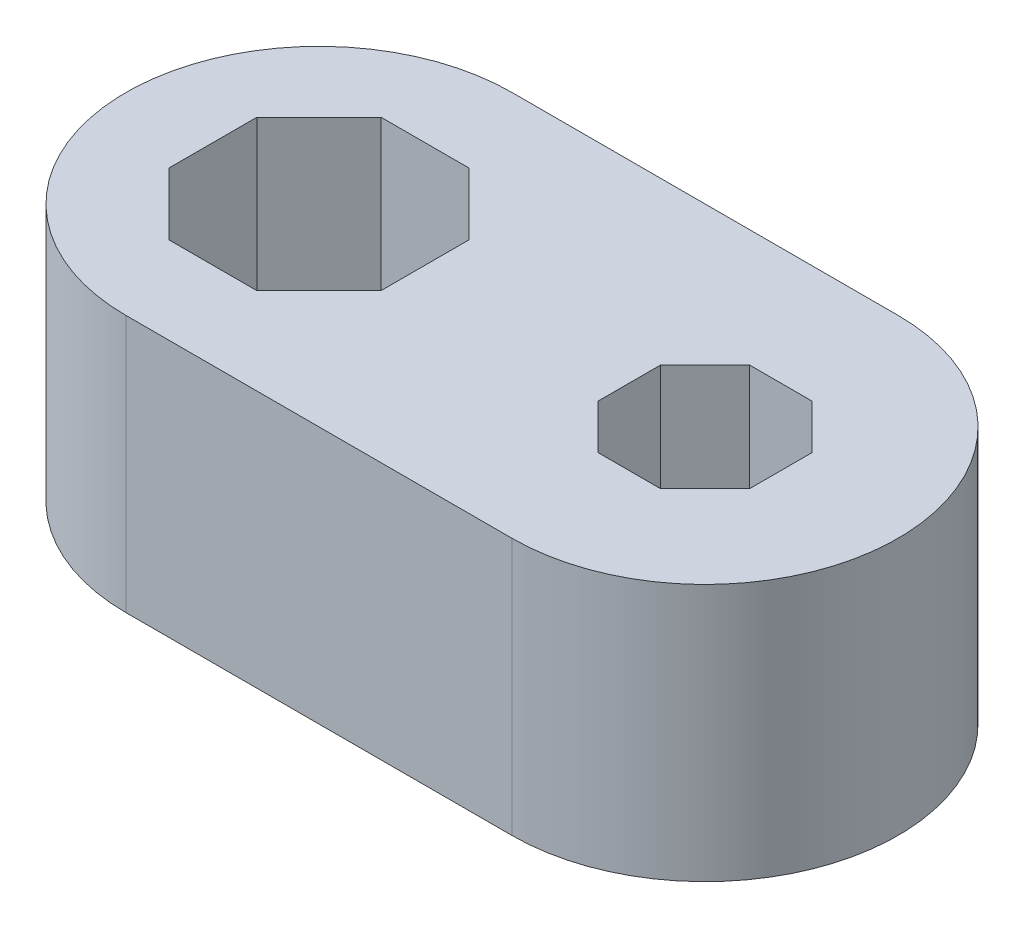
ISO-10303-21;
HEADER;
FILE_DESCRIPTION(('STEP AP214'),'2;1');
FILE_NAME('part.step','',(''),(''),'','','');
FILE_SCHEMA(('AUTOMOTIVE_DESIGN { 1 0 10303 214 1 1 1 1 }'));
ENDSEC;
DATA;
#1=APPLICATION_CONTEXT('core data for automotive mechanical design processes');
#2=APPLICATION_PROTOCOL_DEFINITION('international standard','automotive_design',2000,#1);
#3=PRODUCT_CONTEXT('',#1,'mechanical');
#4=PRODUCT('Part','Part','',(#3));
#5=PRODUCT_RELATED_PRODUCT_CATEGORY('part','',(#4));
#6=PRODUCT_DEFINITION_FORMATION('','',#4);
#7=PRODUCT_DEFINITION_CONTEXT('part definition',#1,'design');
#8=PRODUCT_DEFINITION('design','',#6,#7);
#9=PRODUCT_DEFINITION_SHAPE('','',#8);
#10=(LENGTH_UNIT() NAMED_UNIT(*) SI_UNIT(.MILLI.,.METRE.));
#11=(NAMED_UNIT(*) PLANE_ANGLE_UNIT() SI_UNIT($,.RADIAN.));
#12=(NAMED_UNIT(*) SI_UNIT($,.STERADIAN.) SOLID_ANGLE_UNIT());
#13=UNCERTAINTY_MEASURE_WITH_UNIT(LENGTH_MEASURE(1.E-05),#10,'distance_accuracy_value','');
#14=(GEOMETRIC_REPRESENTATION_CONTEXT(3) GLOBAL_UNCERTAINTY_ASSIGNED_CONTEXT((#13)) GLOBAL_UNIT_ASSIGNED_CONTEXT((#10,
#11,#12)) REPRESENTATION_CONTEXT('',''));
#15=CARTESIAN_POINT('',(0.,0.,0.));
#16=DIRECTION('',(0.,0.,1.));
#17=DIRECTION('',(1.,0.,0.));
#18=AXIS2_PLACEMENT_3D('',#15,#16,#17);
#19=CARTESIAN_POINT('',(6.,8.,0.));
#20=DIRECTION('',(0.,-1.,0.));
#21=DIRECTION('',(0.,0.,-1.));
#22=AXIS2_PLACEMENT_3D('',#19,#20,#21);
#23=PLANE('',#22);
#24=DIRECTION('',(-0.707106781186548,0.,-0.707106781186547));
#25=VECTOR('',#24,1.);
#26=CARTESIAN_POINT('',(-2.70174971535712,8.,-1.36618));
#27=LINE('',#26,#25);
#28=CARTESIAN_POINT('',(-2.70174971535712,8.,-1.36618));
#29=VERTEX_POINT('',#28);
#30=CARTESIAN_POINT('',(-4.63382,8.,-3.29825028464288));
#31=VERTEX_POINT('',#30);
#32=EDGE_CURVE('E266',#29,#31,#27,.T.);
#33=ORIENTED_EDGE('',*,*,#32,.F.);
#34=DIRECTION('',(0.,0.,-1.));
#35=VECTOR('',#34,1.);
#36=CARTESIAN_POINT('',(-2.70174971535712,8.,1.36618));
#37=LINE('',#36,#35);
#38=CARTESIAN_POINT('',(-2.70174971535712,8.,1.36618));
#39=VERTEX_POINT('',#38);
#40=EDGE_CURVE('E289',#39,#29,#37,.T.);
#41=ORIENTED_EDGE('',*,*,#40,.F.);
#42=DIRECTION('',(0.707106781186547,0.,-0.707106781186548));
#43=VECTOR('',#42,1.);
#44=CARTESIAN_POINT('',(-4.63382,8.,3.29825028464288));
#45=LINE('',#44,#43);
#46=CARTESIAN_POINT('',(-4.63382,8.,3.29825028464288));
#47=VERTEX_POINT('',#46);
#48=EDGE_CURVE('E285',#47,#39,#45,.T.);
#49=ORIENTED_EDGE('',*,*,#48,.F.);
#50=DIRECTION('',(1.,0.,0.));
#51=VECTOR('',#50,1.);
#52=CARTESIAN_POINT('',(-7.36618,8.,3.29825028464288));
#53=LINE('',#52,#51);
#54=CARTESIAN_POINT('',(-7.36618,8.,3.29825028464288));
#55=VERTEX_POINT('',#54);
#56=EDGE_CURVE('E282',#55,#47,#53,.T.);
#57=ORIENTED_EDGE('',*,*,#56,.F.);
#58=DIRECTION('',(0.707106781186547,0.,0.707106781186547));
#59=VECTOR('',#58,1.);
#60=CARTESIAN_POINT('',(-9.29825028464288,8.,1.36618));
#61=LINE('',#60,#59);
#62=CARTESIAN_POINT('',(-9.29825028464288,8.,1.36618));
#63=VERTEX_POINT('',#62);
#64=EDGE_CURVE('E279',#63,#55,#61,.T.);
#65=ORIENTED_EDGE('',*,*,#64,.F.);
#66=DIRECTION('',(0.,0.,1.));
#67=VECTOR('',#66,1.);
#68=CARTESIAN_POINT('',(-9.29825028464288,8.,-1.36618));
#69=LINE('',#68,#67);
#70=CARTESIAN_POINT('',(-9.29825028464288,8.,-1.36618));
#71=VERTEX_POINT('',#70);
#72=EDGE_CURVE('E276',#71,#63,#69,.T.);
#73=ORIENTED_EDGE('',*,*,#72,.F.);
#74=DIRECTION('',(-0.707106781186547,0.,0.707106781186548));
#75=VECTOR('',#74,1.);
#76=CARTESIAN_POINT('',(-7.36618,8.,-3.29825028464288));
#77=LINE('',#76,#75);
#78=CARTESIAN_POINT('',(-7.36618,8.,-3.29825028464288));
#79=VERTEX_POINT('',#78);
#80=EDGE_CURVE('E273',#79,#71,#77,.T.);
#81=ORIENTED_EDGE('',*,*,#80,.F.);
#82=DIRECTION('',(-1.,0.,0.));
#83=VECTOR('',#82,1.);
#84=CARTESIAN_POINT('',(-4.63382,8.,-3.29825028464288));
#85=LINE('',#84,#83);
#86=EDGE_CURVE('E269',#31,#79,#85,.T.);
#87=ORIENTED_EDGE('',*,*,#86,.F.);
#88=EDGE_LOOP('',(#33,#41,#49,#57,#65,#73,#81,#87));
#89=FACE_BOUND('',#88,.T.);
#90=CARTESIAN_POINT('',(6.,8.,0.));
#91=DIRECTION('',(0.,1.,0.));
#92=DIRECTION('',(0.,0.,-1.));
#93=AXIS2_PLACEMENT_3D('',#90,#91,#92);
#94=CIRCLE('',#93,6.);
#95=CARTESIAN_POINT('',(6.,8.,6.));
#96=VERTEX_POINT('',#95);
#97=CARTESIAN_POINT('',(6.,8.,-6.));
#98=VERTEX_POINT('',#97);
#99=EDGE_CURVE('E349',#96,#98,#94,.T.);
#100=ORIENTED_EDGE('',*,*,#99,.T.);
#101=DIRECTION('',(-1.,0.,0.));
#102=VECTOR('',#101,1.);
#103=CARTESIAN_POINT('',(-6.,8.,-6.));
#104=LINE('',#103,#102);
#105=CARTESIAN_POINT('',(-6.,8.,-6.));
#106=VERTEX_POINT('',#105);
#107=EDGE_CURVE('E353',#98,#106,#104,.T.);
#108=ORIENTED_EDGE('',*,*,#107,.T.);
#109=CARTESIAN_POINT('',(-6.,8.,0.));
#110=DIRECTION('',(0.,1.,0.));
#111=DIRECTION('',(0.,0.,1.));
#112=AXIS2_PLACEMENT_3D('',#109,#110,#111);
#113=CIRCLE('',#112,6.);
#114=CARTESIAN_POINT('',(-6.,8.,6.));
#115=VERTEX_POINT('',#114);
#116=EDGE_CURVE('E357',#106,#115,#113,.T.);
#117=ORIENTED_EDGE('',*,*,#116,.T.);
#118=DIRECTION('',(1.,0.,0.));
#119=VECTOR('',#118,1.);
#120=CARTESIAN_POINT('',(-6.,8.,6.));
#121=LINE('',#120,#119);
#122=EDGE_CURVE('E360',#115,#96,#121,.T.);
#123=ORIENTED_EDGE('',*,*,#122,.T.);
#124=EDGE_LOOP('',(#100,#108,#117,#123));
#125=FACE_BOUND('',#124,.T.);
#126=DIRECTION('',(0.,0.,-1.));
#127=VECTOR('',#126,1.);
#128=CARTESIAN_POINT('',(8.35589823377397,8.,0.975844999999994));
#129=LINE('',#128,#127);
#130=CARTESIAN_POINT('',(8.35589823377397,8.,0.975844999999994));
#131=VERTEX_POINT('',#130);
#132=CARTESIAN_POINT('',(8.35589823377397,8.,-0.975845000000005));
#133=VERTEX_POINT('',#132);
#134=EDGE_CURVE('E177',#131,#133,#129,.T.);
#135=ORIENTED_EDGE('',*,*,#134,.F.);
#136=DIRECTION('',(0.707106781186547,0.,-0.707106781186548));
#137=VECTOR('',#136,1.);
#138=CARTESIAN_POINT('',(6.975845,8.,2.35589823377397));
#139=LINE('',#138,#137);
#140=CARTESIAN_POINT('',(6.975845,8.,2.35589823377397));
#141=VERTEX_POINT('',#140);
#142=EDGE_CURVE('E218',#141,#131,#139,.T.);
#143=ORIENTED_EDGE('',*,*,#142,.F.);
#144=DIRECTION('',(1.,0.,0.));
#145=VECTOR('',#144,1.);
#146=CARTESIAN_POINT('',(5.024155,8.,2.35589823377397));
#147=LINE('',#146,#145);
#148=CARTESIAN_POINT('',(5.024155,8.,2.35589823377397));
#149=VERTEX_POINT('',#148);
#150=EDGE_CURVE('E215',#149,#141,#147,.T.);
#151=ORIENTED_EDGE('',*,*,#150,.F.);
#152=DIRECTION('',(0.707106781186547,0.,0.707106781186548));
#153=VECTOR('',#152,1.);
#154=CARTESIAN_POINT('',(3.64410176622603,8.,0.975844999999996));
#155=LINE('',#154,#153);
#156=CARTESIAN_POINT('',(3.64410176622603,8.,0.975844999999996));
#157=VERTEX_POINT('',#156);
#158=EDGE_CURVE('E212',#157,#149,#155,.T.);
#159=ORIENTED_EDGE('',*,*,#158,.F.);
#160=DIRECTION('',(0.,0.,1.));
#161=VECTOR('',#160,1.);
#162=CARTESIAN_POINT('',(3.64410176622603,8.,-0.975845000000002));
#163=LINE('',#162,#161);
#164=CARTESIAN_POINT('',(3.64410176622603,8.,-0.975845000000002));
#165=VERTEX_POINT('',#164);
#166=EDGE_CURVE('E209',#165,#157,#163,.T.);
#167=ORIENTED_EDGE('',*,*,#166,.F.);
#168=DIRECTION('',(-0.707106781186548,0.,0.707106781186547));
#169=VECTOR('',#168,1.);
#170=CARTESIAN_POINT('',(5.024155,8.,-2.35589823377397));
#171=LINE('',#170,#169);
#172=CARTESIAN_POINT('',(5.024155,8.,-2.35589823377397));
#173=VERTEX_POINT('',#172);
#174=EDGE_CURVE('E204',#173,#165,#171,.T.);
#175=ORIENTED_EDGE('',*,*,#174,.F.);
#176=DIRECTION('',(-1.,0.,0.));
#177=VECTOR('',#176,1.);
#178=CARTESIAN_POINT('',(6.975845,8.,-2.35589823377397));
#179=LINE('',#178,#177);
#180=CARTESIAN_POINT('',(6.975845,8.,-2.35589823377397));
#181=VERTEX_POINT('',#180);
#182=EDGE_CURVE('E200',#181,#173,#179,.T.);
#183=ORIENTED_EDGE('',*,*,#182,.F.);
#184=DIRECTION('',(-0.707106781186548,0.,-0.707106781186547));
#185=VECTOR('',#184,1.);
#186=CARTESIAN_POINT('',(8.35589823377397,8.,-0.975845000000005));
#187=LINE('',#186,#185);
#188=EDGE_CURVE('E186',#133,#181,#187,.T.);
#189=ORIENTED_EDGE('',*,*,#188,.F.);
#190=EDGE_LOOP('',(#135,#143,#151,#159,#167,#175,#183,#189));
#191=FACE_BOUND('',#190,.T.);
#192=ADVANCED_FACE('F39',(#89,#125,#191),#23,.F.);
#193=CARTESIAN_POINT('',(6.,0.,0.));
#194=DIRECTION('',(0.,-1.,0.));
#195=DIRECTION('',(0.,0.,-1.));
#196=AXIS2_PLACEMENT_3D('',#193,#194,#195);
#197=PLANE('',#196);
#198=CARTESIAN_POINT('',(6.,0.,0.));
#199=DIRECTION('',(0.,1.,0.));
#200=DIRECTION('',(0.,0.,-1.));
#201=AXIS2_PLACEMENT_3D('',#198,#199,#200);
#202=CIRCLE('',#201,6.);
#203=CARTESIAN_POINT('',(6.,0.,6.));
#204=VERTEX_POINT('',#203);
#205=CARTESIAN_POINT('',(6.,0.,-6.));
#206=VERTEX_POINT('',#205);
#207=EDGE_CURVE('E348',#204,#206,#202,.T.);
#208=ORIENTED_EDGE('',*,*,#207,.F.);
#209=DIRECTION('',(1.,0.,0.));
#210=VECTOR('',#209,1.);
#211=CARTESIAN_POINT('',(-6.,0.,6.));
#212=LINE('',#211,#210);
#213=CARTESIAN_POINT('',(-6.,0.,6.));
#214=VERTEX_POINT('',#213);
#215=EDGE_CURVE('E354',#214,#204,#212,.T.);
#216=ORIENTED_EDGE('',*,*,#215,.F.);
#217=CARTESIAN_POINT('',(-6.,0.,0.));
#218=DIRECTION('',(0.,1.,0.));
#219=DIRECTION('',(0.,0.,1.));
#220=AXIS2_PLACEMENT_3D('',#217,#218,#219);
#221=CIRCLE('',#220,6.);
#222=CARTESIAN_POINT('',(-6.,0.,-6.));
#223=VERTEX_POINT('',#222);
#224=EDGE_CURVE('E370',#223,#214,#221,.T.);
#225=ORIENTED_EDGE('',*,*,#224,.F.);
#226=DIRECTION('',(-1.,0.,0.));
#227=VECTOR('',#226,1.);
#228=CARTESIAN_POINT('',(-6.,0.,-6.));
#229=LINE('',#228,#227);
#230=EDGE_CURVE('E367',#206,#223,#229,.T.);
#231=ORIENTED_EDGE('',*,*,#230,.F.);
#232=EDGE_LOOP('',(#208,#216,#225,#231));
#233=FACE_BOUND('',#232,.T.);
#234=DIRECTION('',(0.,0.,-1.));
#235=VECTOR('',#234,1.);
#236=CARTESIAN_POINT('',(-2.70174971535712,0.,1.36618));
#237=LINE('',#236,#235);
#238=CARTESIAN_POINT('',(-2.70174971535712,0.,1.36618));
#239=VERTEX_POINT('',#238);
#240=CARTESIAN_POINT('',(-2.70174971535712,0.,-1.36618));
#241=VERTEX_POINT('',#240);
#242=EDGE_CURVE('E270',#239,#241,#237,.T.);
#243=ORIENTED_EDGE('',*,*,#242,.T.);
#244=DIRECTION('',(-0.707106781186548,0.,-0.707106781186547));
#245=VECTOR('',#244,1.);
#246=CARTESIAN_POINT('',(-2.70174971535712,0.,-1.36618));
#247=LINE('',#246,#245);
#248=CARTESIAN_POINT('',(-4.63382,0.,-3.29825028464288));
#249=VERTEX_POINT('',#248);
#250=EDGE_CURVE('E195',#241,#249,#247,.T.);
#251=ORIENTED_EDGE('',*,*,#250,.T.);
#252=DIRECTION('',(-1.,0.,0.));
#253=VECTOR('',#252,1.);
#254=CARTESIAN_POINT('',(-4.63382,0.,-3.29825028464288));
#255=LINE('',#254,#253);
#256=CARTESIAN_POINT('',(-7.36618,0.,-3.29825028464288));
#257=VERTEX_POINT('',#256);
#258=EDGE_CURVE('E296',#249,#257,#255,.T.);
#259=ORIENTED_EDGE('',*,*,#258,.T.);
#260=DIRECTION('',(-0.707106781186547,0.,0.707106781186548));
#261=VECTOR('',#260,1.);
#262=CARTESIAN_POINT('',(-7.36618,0.,-3.29825028464288));
#263=LINE('',#262,#261);
#264=CARTESIAN_POINT('',(-9.29825028464288,0.,-1.36618));
#265=VERTEX_POINT('',#264);
#266=EDGE_CURVE('E300',#257,#265,#263,.T.);
#267=ORIENTED_EDGE('',*,*,#266,.T.);
#268=DIRECTION('',(0.,0.,1.));
#269=VECTOR('',#268,1.);
#270=CARTESIAN_POINT('',(-9.29825028464288,0.,-1.36618));
#271=LINE('',#270,#269);
#272=CARTESIAN_POINT('',(-9.29825028464288,0.,1.36618));
#273=VERTEX_POINT('',#272);
#274=EDGE_CURVE('E304',#265,#273,#271,.T.);
#275=ORIENTED_EDGE('',*,*,#274,.T.);
#276=DIRECTION('',(0.707106781186547,0.,0.707106781186547));
#277=VECTOR('',#276,1.);
#278=CARTESIAN_POINT('',(-9.29825028464288,0.,1.36618));
#279=LINE('',#278,#277);
#280=CARTESIAN_POINT('',(-7.36618,0.,3.29825028464288));
#281=VERTEX_POINT('',#280);
#282=EDGE_CURVE('E308',#273,#281,#279,.T.);
#283=ORIENTED_EDGE('',*,*,#282,.T.);
#284=DIRECTION('',(1.,0.,0.));
#285=VECTOR('',#284,1.);
#286=CARTESIAN_POINT('',(-7.36618,0.,3.29825028464288));
#287=LINE('',#286,#285);
#288=CARTESIAN_POINT('',(-4.63382,0.,3.29825028464288));
#289=VERTEX_POINT('',#288);
#290=EDGE_CURVE('E312',#281,#289,#287,.T.);
#291=ORIENTED_EDGE('',*,*,#290,.T.);
#292=DIRECTION('',(0.707106781186547,0.,-0.707106781186548));
#293=VECTOR('',#292,1.);
#294=CARTESIAN_POINT('',(-4.63382,0.,3.29825028464288));
#295=LINE('',#294,#293);
#296=EDGE_CURVE('E316',#289,#239,#295,.T.);
#297=ORIENTED_EDGE('',*,*,#296,.T.);
#298=EDGE_LOOP('',(#243,#251,#259,#267,#275,#283,#291,#297));
#299=FACE_BOUND('',#298,.T.);
#300=DIRECTION('',(0.707106781186547,0.,-0.707106781186548));
#301=VECTOR('',#300,1.);
#302=CARTESIAN_POINT('',(6.975845,0.,2.35589823377397));
#303=LINE('',#302,#301);
#304=CARTESIAN_POINT('',(6.975845,0.,2.35589823377397));
#305=VERTEX_POINT('',#304);
#306=CARTESIAN_POINT('',(8.35589823377397,0.,0.975844999999996));
#307=VERTEX_POINT('',#306);
#308=EDGE_CURVE('E187',#305,#307,#303,.T.);
#309=ORIENTED_EDGE('',*,*,#308,.T.);
#310=DIRECTION('',(0.,0.,-1.));
#311=VECTOR('',#310,1.);
#312=CARTESIAN_POINT('',(8.35589823377397,0.,0.975844999999994));
#313=LINE('',#312,#311);
#314=CARTESIAN_POINT('',(8.35589823377397,0.,-0.975845000000005));
#315=VERTEX_POINT('',#314);
#316=EDGE_CURVE('E63',#307,#315,#313,.T.);
#317=ORIENTED_EDGE('',*,*,#316,.T.);
#318=DIRECTION('',(-0.707106781186548,0.,-0.707106781186547));
#319=VECTOR('',#318,1.);
#320=CARTESIAN_POINT('',(8.35589823377397,0.,-0.975845000000005));
#321=LINE('',#320,#319);
#322=CARTESIAN_POINT('',(6.975845,0.,-2.35589823377397));
#323=VERTEX_POINT('',#322);
#324=EDGE_CURVE('E193',#315,#323,#321,.T.);
#325=ORIENTED_EDGE('',*,*,#324,.T.);
#326=DIRECTION('',(-1.,0.,0.));
#327=VECTOR('',#326,1.);
#328=CARTESIAN_POINT('',(6.975845,0.,-2.35589823377397));
#329=LINE('',#328,#327);
#330=CARTESIAN_POINT('',(5.024155,0.,-2.35589823377397));
#331=VERTEX_POINT('',#330);
#332=EDGE_CURVE('E225',#323,#331,#329,.T.);
#333=ORIENTED_EDGE('',*,*,#332,.T.);
#334=DIRECTION('',(-0.707106781186548,0.,0.707106781186547));
#335=VECTOR('',#334,1.);
#336=CARTESIAN_POINT('',(5.024155,0.,-2.35589823377397));
#337=LINE('',#336,#335);
#338=CARTESIAN_POINT('',(3.64410176622603,0.,-0.975845000000002));
#339=VERTEX_POINT('',#338);
#340=EDGE_CURVE('E229',#331,#339,#337,.T.);
#341=ORIENTED_EDGE('',*,*,#340,.T.);
#342=DIRECTION('',(0.,0.,1.));
#343=VECTOR('',#342,1.);
#344=CARTESIAN_POINT('',(3.64410176622603,0.,-0.975845000000002));
#345=LINE('',#344,#343);
#346=CARTESIAN_POINT('',(3.64410176622603,0.,0.975844999999996));
#347=VERTEX_POINT('',#346);
#348=EDGE_CURVE('E233',#339,#347,#345,.T.);
#349=ORIENTED_EDGE('',*,*,#348,.T.);
#350=DIRECTION('',(0.707106781186547,0.,0.707106781186548));
#351=VECTOR('',#350,1.);
#352=CARTESIAN_POINT('',(3.64410176622603,0.,0.975844999999996));
#353=LINE('',#352,#351);
#354=CARTESIAN_POINT('',(5.024155,0.,2.35589823377397));
#355=VERTEX_POINT('',#354);
#356=EDGE_CURVE('E237',#347,#355,#353,.T.);
#357=ORIENTED_EDGE('',*,*,#356,.T.);
#358=DIRECTION('',(1.,0.,0.));
#359=VECTOR('',#358,1.);
#360=CARTESIAN_POINT('',(5.024155,0.,2.35589823377397));
#361=LINE('',#360,#359);
#362=EDGE_CURVE('E241',#355,#305,#361,.T.);
#363=ORIENTED_EDGE('',*,*,#362,.T.);
#364=EDGE_LOOP('',(#309,#317,#325,#333,#341,#349,#357,#363));
#365=FACE_BOUND('',#364,.T.);
#366=ADVANCED_FACE('F393',(#233,#299,#365),#197,.T.);
#367=CARTESIAN_POINT('',(6.,8.,0.));
#368=DIRECTION('',(0.,-1.,0.));
#369=DIRECTION('',(0.,0.,-1.));
#370=AXIS2_PLACEMENT_3D('',#367,#368,#369);
#371=CYLINDRICAL_SURFACE('',#370,6.);
#372=ORIENTED_EDGE('',*,*,#207,.T.);
#373=DIRECTION('',(0.,-1.,0.));
#374=VECTOR('',#373,1.);
#375=CARTESIAN_POINT('',(6.,8.,-6.));
#376=LINE('',#375,#374);
#377=EDGE_CURVE('E11',#98,#206,#376,.T.);
#378=ORIENTED_EDGE('',*,*,#377,.F.);
#379=ORIENTED_EDGE('',*,*,#99,.F.);
#380=DIRECTION('',(0.,-1.,0.));
#381=VECTOR('',#380,1.);
#382=CARTESIAN_POINT('',(6.,8.,6.));
#383=LINE('',#382,#381);
#384=EDGE_CURVE('E363',#96,#204,#383,.T.);
#385=ORIENTED_EDGE('',*,*,#384,.T.);
#386=EDGE_LOOP('',(#372,#378,#379,#385));
#387=FACE_BOUND('',#386,.T.);
#388=ADVANCED_FACE('F41',(#387),#371,.T.);
#389=CARTESIAN_POINT('',(-6.,8.,-6.));
#390=DIRECTION('',(0.,0.,1.));
#391=DIRECTION('',(1.,0.,0.));
#392=AXIS2_PLACEMENT_3D('',#389,#390,#391);
#393=PLANE('',#392);
#394=ORIENTED_EDGE('',*,*,#230,.T.);
#395=DIRECTION('',(0.,-1.,0.));
#396=VECTOR('',#395,1.);
#397=CARTESIAN_POINT('',(-6.,8.,-6.));
#398=LINE('',#397,#396);
#399=EDGE_CURVE('E48',#106,#223,#398,.T.);
#400=ORIENTED_EDGE('',*,*,#399,.F.);
#401=ORIENTED_EDGE('',*,*,#107,.F.);
#402=ORIENTED_EDGE('',*,*,#377,.T.);
#403=EDGE_LOOP('',(#394,#400,#401,#402));
#404=FACE_BOUND('',#403,.T.);
#405=ADVANCED_FACE('F403',(#404),#393,.F.);
#406=CARTESIAN_POINT('',(-6.,8.,0.));
#407=DIRECTION('',(0.,-1.,0.));
#408=DIRECTION('',(0.,0.,-1.));
#409=AXIS2_PLACEMENT_3D('',#406,#407,#408);
#410=CYLINDRICAL_SURFACE('',#409,6.);
#411=ORIENTED_EDGE('',*,*,#224,.T.);
#412=DIRECTION('',(0.,-1.,0.));
#413=VECTOR('',#412,1.);
#414=CARTESIAN_POINT('',(-6.,8.,6.));
#415=LINE('',#414,#413);
#416=EDGE_CURVE('E378',#115,#214,#415,.T.);
#417=ORIENTED_EDGE('',*,*,#416,.F.);
#418=ORIENTED_EDGE('',*,*,#116,.F.);
#419=ORIENTED_EDGE('',*,*,#399,.T.);
#420=EDGE_LOOP('',(#411,#417,#418,#419));
#421=FACE_BOUND('',#420,.T.);
#422=ADVANCED_FACE('F387',(#421),#410,.T.);
#423=CARTESIAN_POINT('',(-6.,8.,6.));
#424=DIRECTION('',(0.,0.,-1.));
#425=DIRECTION('',(-1.,0.,0.));
#426=AXIS2_PLACEMENT_3D('',#423,#424,#425);
#427=PLANE('',#426);
#428=ORIENTED_EDGE('',*,*,#215,.T.);
#429=ORIENTED_EDGE('',*,*,#384,.F.);
#430=ORIENTED_EDGE('',*,*,#122,.F.);
#431=ORIENTED_EDGE('',*,*,#416,.T.);
#432=EDGE_LOOP('',(#428,#429,#430,#431));
#433=FACE_BOUND('',#432,.T.);
#434=ADVANCED_FACE('F397',(#433),#427,.F.);
#435=CARTESIAN_POINT('',(-2.70174971535712,8.,-1.36618));
#436=DIRECTION('',(-0.707106781186547,0.,0.707106781186548));
#437=DIRECTION('',(0.707106781186548,0.,0.707106781186547));
#438=AXIS2_PLACEMENT_3D('',#435,#436,#437);
#439=PLANE('',#438);
#440=ORIENTED_EDGE('',*,*,#250,.F.);
#441=DIRECTION('',(0.,-1.,0.));
#442=VECTOR('',#441,1.);
#443=CARTESIAN_POINT('',(-2.70174971535712,8.,-1.36618));
#444=LINE('',#443,#442);
#445=EDGE_CURVE('E292',#29,#241,#444,.T.);
#446=ORIENTED_EDGE('',*,*,#445,.F.);
#447=ORIENTED_EDGE('',*,*,#32,.T.);
#448=DIRECTION('',(0.,-1.,0.));
#449=VECTOR('',#448,1.);
#450=CARTESIAN_POINT('',(-4.63382,8.,-3.29825028464288));
#451=LINE('',#450,#449);
#452=EDGE_CURVE('E344',#31,#249,#451,.T.);
#453=ORIENTED_EDGE('',*,*,#452,.T.);
#454=EDGE_LOOP('',(#440,#446,#447,#453));
#455=FACE_BOUND('',#454,.T.);
#456=ADVANCED_FACE('F419',(#455),#439,.T.);
#457=CARTESIAN_POINT('',(-4.63382,8.,-3.29825028464288));
#458=DIRECTION('',(0.,0.,1.));
#459=DIRECTION('',(1.,0.,0.));
#460=AXIS2_PLACEMENT_3D('',#457,#458,#459);
#461=PLANE('',#460);
#462=ORIENTED_EDGE('',*,*,#258,.F.);
#463=ORIENTED_EDGE('',*,*,#452,.F.);
#464=ORIENTED_EDGE('',*,*,#86,.T.);
#465=DIRECTION('',(0.,-1.,0.));
#466=VECTOR('',#465,1.);
#467=CARTESIAN_POINT('',(-7.36618,8.,-3.29825028464288));
#468=LINE('',#467,#466);
#469=EDGE_CURVE('E341',#79,#257,#468,.T.);
#470=ORIENTED_EDGE('',*,*,#469,.T.);
#471=EDGE_LOOP('',(#462,#463,#464,#470));
#472=FACE_BOUND('',#471,.T.);
#473=ADVANCED_FACE('F426',(#472),#461,.T.);
#474=CARTESIAN_POINT('',(-7.36618,8.,-3.29825028464288));
#475=DIRECTION('',(0.707106781186548,0.,0.707106781186547));
#476=DIRECTION('',(0.707106781186547,0.,-0.707106781186548));
#477=AXIS2_PLACEMENT_3D('',#474,#475,#476);
#478=PLANE('',#477);
#479=ORIENTED_EDGE('',*,*,#266,.F.);
#480=ORIENTED_EDGE('',*,*,#469,.F.);
#481=ORIENTED_EDGE('',*,*,#80,.T.);
#482=DIRECTION('',(0.,-1.,0.));
#483=VECTOR('',#482,1.);
#484=CARTESIAN_POINT('',(-9.29825028464288,8.,-1.36618));
#485=LINE('',#484,#483);
#486=EDGE_CURVE('E338',#71,#265,#485,.T.);
#487=ORIENTED_EDGE('',*,*,#486,.T.);
#488=EDGE_LOOP('',(#479,#480,#481,#487));
#489=FACE_BOUND('',#488,.T.);
#490=ADVANCED_FACE('F431',(#489),#478,.T.);
#491=CARTESIAN_POINT('',(-9.29825028464288,8.,-1.36618));
#492=DIRECTION('',(1.,0.,0.));
#493=DIRECTION('',(0.,0.,-1.));
#494=AXIS2_PLACEMENT_3D('',#491,#492,#493);
#495=PLANE('',#494);
#496=ORIENTED_EDGE('',*,*,#274,.F.);
#497=ORIENTED_EDGE('',*,*,#486,.F.);
#498=ORIENTED_EDGE('',*,*,#72,.T.);
#499=DIRECTION('',(0.,-1.,0.));
#500=VECTOR('',#499,1.);
#501=CARTESIAN_POINT('',(-9.29825028464288,8.,1.36618));
#502=LINE('',#501,#500);
#503=EDGE_CURVE('E335',#63,#273,#502,.T.);
#504=ORIENTED_EDGE('',*,*,#503,.T.);
#505=EDGE_LOOP('',(#496,#497,#498,#504));
#506=FACE_BOUND('',#505,.T.);
#507=ADVANCED_FACE('F456',(#506),#495,.T.);
#508=CARTESIAN_POINT('',(-9.29825028464288,8.,1.36618));
#509=DIRECTION('',(0.707106781186547,0.,-0.707106781186547));
#510=DIRECTION('',(-0.707106781186548,0.,-0.707106781186548));
#511=AXIS2_PLACEMENT_3D('',#508,#509,#510);
#512=PLANE('',#511);
#513=ORIENTED_EDGE('',*,*,#282,.F.);
#514=ORIENTED_EDGE('',*,*,#503,.F.);
#515=ORIENTED_EDGE('',*,*,#64,.T.);
#516=DIRECTION('',(0.,-1.,0.));
#517=VECTOR('',#516,1.);
#518=CARTESIAN_POINT('',(-7.36618,8.,3.29825028464288));
#519=LINE('',#518,#517);
#520=EDGE_CURVE('E332',#55,#281,#519,.T.);
#521=ORIENTED_EDGE('',*,*,#520,.T.);
#522=EDGE_LOOP('',(#513,#514,#515,#521));
#523=FACE_BOUND('',#522,.T.);
#524=ADVANCED_FACE('F461',(#523),#512,.T.);
#525=CARTESIAN_POINT('',(-7.36618,8.,3.29825028464288));
#526=DIRECTION('',(0.,0.,-1.));
#527=DIRECTION('',(-1.,0.,0.));
#528=AXIS2_PLACEMENT_3D('',#525,#526,#527);
#529=PLANE('',#528);
#530=ORIENTED_EDGE('',*,*,#290,.F.);
#531=ORIENTED_EDGE('',*,*,#520,.F.);
#532=ORIENTED_EDGE('',*,*,#56,.T.);
#533=DIRECTION('',(0.,-1.,0.));
#534=VECTOR('',#533,1.);
#535=CARTESIAN_POINT('',(-4.63382,8.,3.29825028464288));
#536=LINE('',#535,#534);
#537=EDGE_CURVE('E329',#47,#289,#536,.T.);
#538=ORIENTED_EDGE('',*,*,#537,.T.);
#539=EDGE_LOOP('',(#530,#531,#532,#538));
#540=FACE_BOUND('',#539,.T.);
#541=ADVANCED_FACE('F464',(#540),#529,.T.);
#542=CARTESIAN_POINT('',(-4.63382,8.,3.29825028464288));
#543=DIRECTION('',(-0.707106781186548,0.,-0.707106781186547));
#544=DIRECTION('',(-0.707106781186547,0.,0.707106781186548));
#545=AXIS2_PLACEMENT_3D('',#542,#543,#544);
#546=PLANE('',#545);
#547=ORIENTED_EDGE('',*,*,#296,.F.);
#548=ORIENTED_EDGE('',*,*,#537,.F.);
#549=ORIENTED_EDGE('',*,*,#48,.T.);
#550=DIRECTION('',(0.,-1.,0.));
#551=VECTOR('',#550,1.);
#552=CARTESIAN_POINT('',(-2.70174971535712,8.,1.36618));
#553=LINE('',#552,#551);
#554=EDGE_CURVE('E326',#39,#239,#553,.T.);
#555=ORIENTED_EDGE('',*,*,#554,.T.);
#556=EDGE_LOOP('',(#547,#548,#549,#555));
#557=FACE_BOUND('',#556,.T.);
#558=ADVANCED_FACE('F444',(#557),#546,.T.);
#559=CARTESIAN_POINT('',(-2.70174971535712,8.,1.36618));
#560=DIRECTION('',(-1.,0.,0.));
#561=DIRECTION('',(0.,0.,1.));
#562=AXIS2_PLACEMENT_3D('',#559,#560,#561);
#563=PLANE('',#562);
#564=ORIENTED_EDGE('',*,*,#242,.F.);
#565=ORIENTED_EDGE('',*,*,#554,.F.);
#566=ORIENTED_EDGE('',*,*,#40,.T.);
#567=ORIENTED_EDGE('',*,*,#445,.T.);
#568=EDGE_LOOP('',(#564,#565,#566,#567));
#569=FACE_BOUND('',#568,.T.);
#570=ADVANCED_FACE('F437',(#569),#563,.T.);
#571=CARTESIAN_POINT('',(8.35589823377397,8.,0.975844999999994));
#572=DIRECTION('',(-1.,0.,0.));
#573=DIRECTION('',(0.,0.,1.));
#574=AXIS2_PLACEMENT_3D('',#571,#572,#573);
#575=PLANE('',#574);
#576=ORIENTED_EDGE('',*,*,#316,.F.);
#577=DIRECTION('',(0.,-1.,0.));
#578=VECTOR('',#577,1.);
#579=CARTESIAN_POINT('',(8.35589823377397,8.,0.975844999999994));
#580=LINE('',#579,#578);
#581=EDGE_CURVE('E181',#131,#307,#580,.T.);
#582=ORIENTED_EDGE('',*,*,#581,.F.);
#583=ORIENTED_EDGE('',*,*,#134,.T.);
#584=DIRECTION('',(0.,-1.,0.));
#585=VECTOR('',#584,1.);
#586=CARTESIAN_POINT('',(8.35589823377397,8.,-0.975845000000005));
#587=LINE('',#586,#585);
#588=EDGE_CURVE('E180',#133,#315,#587,.T.);
#589=ORIENTED_EDGE('',*,*,#588,.T.);
#590=EDGE_LOOP('',(#576,#582,#583,#589));
#591=FACE_BOUND('',#590,.T.);
#592=ADVANCED_FACE('F179',(#591),#575,.T.);
#593=CARTESIAN_POINT('',(8.35589823377397,8.,-0.975845000000005));
#594=DIRECTION('',(-0.707106781186547,0.,0.707106781186548));
#595=DIRECTION('',(0.707106781186548,0.,0.707106781186547));
#596=AXIS2_PLACEMENT_3D('',#593,#594,#595);
#597=PLANE('',#596);
#598=ORIENTED_EDGE('',*,*,#324,.F.);
#599=ORIENTED_EDGE('',*,*,#588,.F.);
#600=ORIENTED_EDGE('',*,*,#188,.T.);
#601=DIRECTION('',(0.,-1.,0.));
#602=VECTOR('',#601,1.);
#603=CARTESIAN_POINT('',(6.975845,8.,-2.35589823377397));
#604=LINE('',#603,#602);
#605=EDGE_CURVE('E196',#181,#323,#604,.T.);
#606=ORIENTED_EDGE('',*,*,#605,.T.);
#607=EDGE_LOOP('',(#598,#599,#600,#606));
#608=FACE_BOUND('',#607,.T.);
#609=ADVANCED_FACE('F190',(#608),#597,.T.);
#610=CARTESIAN_POINT('',(6.975845,8.,-2.35589823377397));
#611=DIRECTION('',(0.,0.,1.));
#612=DIRECTION('',(1.,0.,0.));
#613=AXIS2_PLACEMENT_3D('',#610,#611,#612);
#614=PLANE('',#613);
#615=ORIENTED_EDGE('',*,*,#332,.F.);
#616=ORIENTED_EDGE('',*,*,#605,.F.);
#617=ORIENTED_EDGE('',*,*,#182,.T.);
#618=DIRECTION('',(0.,-1.,0.));
#619=VECTOR('',#618,1.);
#620=CARTESIAN_POINT('',(5.024155,8.,-2.35589823377397));
#621=LINE('',#620,#619);
#622=EDGE_CURVE('E261',#173,#331,#621,.T.);
#623=ORIENTED_EDGE('',*,*,#622,.T.);
#624=EDGE_LOOP('',(#615,#616,#617,#623));
#625=FACE_BOUND('',#624,.T.);
#626=ADVANCED_FACE('F524',(#625),#614,.T.);
#627=CARTESIAN_POINT('',(5.024155,8.,-2.35589823377397));
#628=DIRECTION('',(0.707106781186547,0.,0.707106781186548));
#629=DIRECTION('',(0.707106781186548,0.,-0.707106781186547));
#630=AXIS2_PLACEMENT_3D('',#627,#628,#629);
#631=PLANE('',#630);
#632=ORIENTED_EDGE('',*,*,#340,.F.);
#633=ORIENTED_EDGE('',*,*,#622,.F.);
#634=ORIENTED_EDGE('',*,*,#174,.T.);
#635=DIRECTION('',(0.,-1.,0.));
#636=VECTOR('',#635,1.);
#637=CARTESIAN_POINT('',(3.64410176622603,8.,-0.975845000000002));
#638=LINE('',#637,#636);
#639=EDGE_CURVE('E258',#165,#339,#638,.T.);
#640=ORIENTED_EDGE('',*,*,#639,.T.);
#641=EDGE_LOOP('',(#632,#633,#634,#640));
#642=FACE_BOUND('',#641,.T.);
#643=ADVANCED_FACE('F533',(#642),#631,.T.);
#644=CARTESIAN_POINT('',(3.64410176622603,8.,-0.975845000000002));
#645=DIRECTION('',(1.,0.,0.));
#646=DIRECTION('',(0.,0.,-1.));
#647=AXIS2_PLACEMENT_3D('',#644,#645,#646);
#648=PLANE('',#647);
#649=ORIENTED_EDGE('',*,*,#348,.F.);
#650=ORIENTED_EDGE('',*,*,#639,.F.);
#651=ORIENTED_EDGE('',*,*,#166,.T.);
#652=DIRECTION('',(0.,-1.,0.));
#653=VECTOR('',#652,1.);
#654=CARTESIAN_POINT('',(3.64410176622603,8.,0.975844999999996));
#655=LINE('',#654,#653);
#656=EDGE_CURVE('E255',#157,#347,#655,.T.);
#657=ORIENTED_EDGE('',*,*,#656,.T.);
#658=EDGE_LOOP('',(#649,#650,#651,#657));
#659=FACE_BOUND('',#658,.T.);
#660=ADVANCED_FACE('F543',(#659),#648,.T.);
#661=CARTESIAN_POINT('',(3.64410176622603,8.,0.975844999999996));
#662=DIRECTION('',(0.707106781186548,0.,-0.707106781186547));
#663=DIRECTION('',(-0.707106781186547,0.,-0.707106781186548));
#664=AXIS2_PLACEMENT_3D('',#661,#662,#663);
#665=PLANE('',#664);
#666=ORIENTED_EDGE('',*,*,#356,.F.);
#667=ORIENTED_EDGE('',*,*,#656,.F.);
#668=ORIENTED_EDGE('',*,*,#158,.T.);
#669=DIRECTION('',(0.,-1.,0.));
#670=VECTOR('',#669,1.);
#671=CARTESIAN_POINT('',(5.024155,8.,2.35589823377397));
#672=LINE('',#671,#670);
#673=EDGE_CURVE('E252',#149,#355,#672,.T.);
#674=ORIENTED_EDGE('',*,*,#673,.T.);
#675=EDGE_LOOP('',(#666,#667,#668,#674));
#676=FACE_BOUND('',#675,.T.);
#677=ADVANCED_FACE('F553',(#676),#665,.T.);
#678=CARTESIAN_POINT('',(5.024155,8.,2.35589823377397));
#679=DIRECTION('',(0.,0.,-1.));
#680=DIRECTION('',(-1.,0.,0.));
#681=AXIS2_PLACEMENT_3D('',#678,#679,#680);
#682=PLANE('',#681);
#683=ORIENTED_EDGE('',*,*,#362,.F.);
#684=ORIENTED_EDGE('',*,*,#673,.F.);
#685=ORIENTED_EDGE('',*,*,#150,.T.);
#686=DIRECTION('',(0.,-1.,0.));
#687=VECTOR('',#686,1.);
#688=CARTESIAN_POINT('',(6.975845,8.,2.35589823377397));
#689=LINE('',#688,#687);
#690=EDGE_CURVE('E55',#141,#305,#689,.T.);
#691=ORIENTED_EDGE('',*,*,#690,.T.);
#692=EDGE_LOOP('',(#683,#684,#685,#691));
#693=FACE_BOUND('',#692,.T.);
#694=ADVANCED_FACE('F563',(#693),#682,.T.);
#695=CARTESIAN_POINT('',(6.975845,8.,2.35589823377397));
#696=DIRECTION('',(-0.707106781186548,0.,-0.707106781186547));
#697=DIRECTION('',(-0.707106781186547,0.,0.707106781186548));
#698=AXIS2_PLACEMENT_3D('',#695,#696,#697);
#699=PLANE('',#698);
#700=ORIENTED_EDGE('',*,*,#308,.F.);
#701=ORIENTED_EDGE('',*,*,#690,.F.);
#702=ORIENTED_EDGE('',*,*,#142,.T.);
#703=ORIENTED_EDGE('',*,*,#581,.T.);
#704=EDGE_LOOP('',(#700,#701,#702,#703));
#705=FACE_BOUND('',#704,.T.);
#706=ADVANCED_FACE('F573',(#705),#699,.T.);
#707=CLOSED_SHELL('',(#192,#366,#388,#405,#422,#434,#456,#473,#490,#507,#524,#541,#558,#570,
#592,#609,#626,#643,#660,#677,#694,#706));
#708=MANIFOLD_SOLID_BREP('B2',#707);
#709=ADVANCED_BREP_SHAPE_REPRESENTATION('',(#18,#708),#14);
#710=SHAPE_DEFINITION_REPRESENTATION(#9,#709);
ENDSEC;
END-ISO-10303-21;
